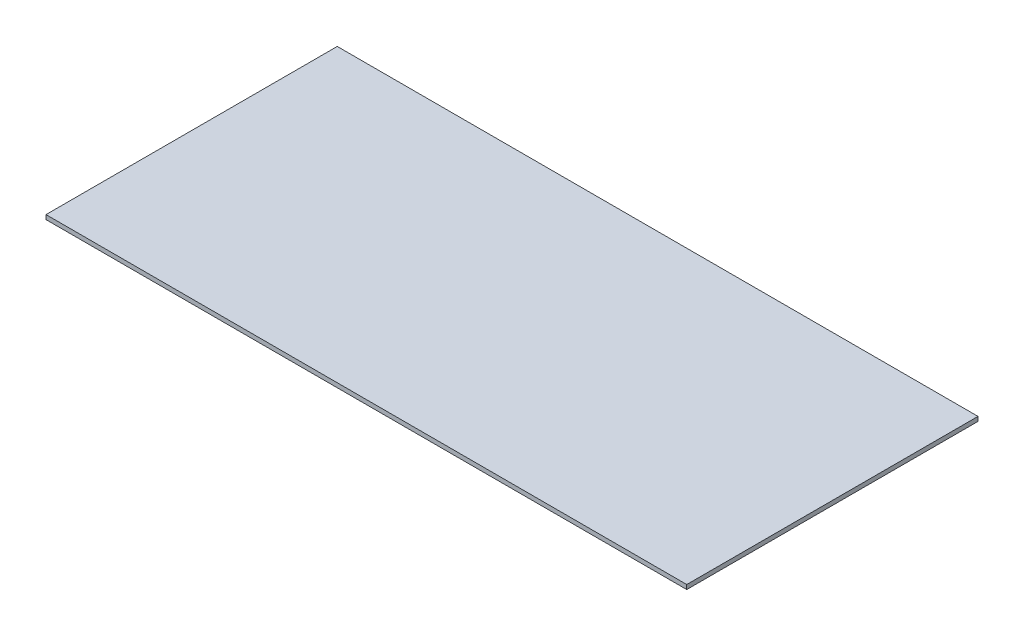
ISO-10303-21;
HEADER;
FILE_DESCRIPTION(('STEP AP214'),'2;1');
FILE_NAME('part.step','',(''),(''),'','','');
FILE_SCHEMA(('AUTOMOTIVE_DESIGN { 1 0 10303 214 1 1 1 1 }'));
ENDSEC;
DATA;
#1=APPLICATION_CONTEXT('core data for automotive mechanical design processes');
#2=APPLICATION_PROTOCOL_DEFINITION('international standard','automotive_design',2000,#1);
#3=PRODUCT_CONTEXT('',#1,'mechanical');
#4=PRODUCT('Part','Part','',(#3));
#5=PRODUCT_RELATED_PRODUCT_CATEGORY('part','',(#4));
#6=PRODUCT_DEFINITION_FORMATION('','',#4);
#7=PRODUCT_DEFINITION_CONTEXT('part definition',#1,'design');
#8=PRODUCT_DEFINITION('design','',#6,#7);
#9=PRODUCT_DEFINITION_SHAPE('','',#8);
#10=(LENGTH_UNIT() NAMED_UNIT(*) SI_UNIT(.MILLI.,.METRE.));
#11=(NAMED_UNIT(*) PLANE_ANGLE_UNIT() SI_UNIT($,.RADIAN.));
#12=(NAMED_UNIT(*) SI_UNIT($,.STERADIAN.) SOLID_ANGLE_UNIT());
#13=UNCERTAINTY_MEASURE_WITH_UNIT(LENGTH_MEASURE(1.E-05),#10,'distance_accuracy_value','');
#14=(GEOMETRIC_REPRESENTATION_CONTEXT(3) GLOBAL_UNCERTAINTY_ASSIGNED_CONTEXT((#13)) GLOBAL_UNIT_ASSIGNED_CONTEXT((#10,
#11,#12)) REPRESENTATION_CONTEXT('',''));
#15=CARTESIAN_POINT('',(0.,0.,0.));
#16=DIRECTION('',(0.,0.,1.));
#17=DIRECTION('',(1.,0.,0.));
#18=AXIS2_PLACEMENT_3D('',#15,#16,#17);
#19=CARTESIAN_POINT('',(16.0802370038619,3.,155.555555555556));
#20=DIRECTION('',(0.,0.,-1.));
#21=DIRECTION('',(-1.,0.,0.));
#22=AXIS2_PLACEMENT_3D('',#19,#20,#21);
#23=PLANE('',#22);
#24=DIRECTION('',(1.,0.,0.));
#25=VECTOR('',#24,1.);
#26=CARTESIAN_POINT('',(16.0802370038619,0.,155.555555555556));
#27=LINE('',#26,#25);
#28=CARTESIAN_POINT('',(16.0802370038619,0.,155.555555555556));
#29=VERTEX_POINT('',#28);
#30=CARTESIAN_POINT('',(456.080237003862,0.,155.555555555556));
#31=VERTEX_POINT('',#30);
#32=EDGE_CURVE('E151',#29,#31,#27,.T.);
#33=ORIENTED_EDGE('',*,*,#32,.T.);
#34=DIRECTION('',(0.,-1.,0.));
#35=VECTOR('',#34,1.);
#36=CARTESIAN_POINT('',(456.080237003862,3.,155.555555555556));
#37=LINE('',#36,#35);
#38=CARTESIAN_POINT('',(456.080237003862,3.,155.555555555556));
#39=VERTEX_POINT('',#38);
#40=EDGE_CURVE('E11',#39,#31,#37,.T.);
#41=ORIENTED_EDGE('',*,*,#40,.F.);
#42=DIRECTION('',(1.,0.,0.));
#43=VECTOR('',#42,1.);
#44=CARTESIAN_POINT('',(16.0802370038619,3.,155.555555555556));
#45=LINE('',#44,#43);
#46=CARTESIAN_POINT('',(16.0802370038619,3.,155.555555555556));
#47=VERTEX_POINT('',#46);
#48=EDGE_CURVE('E157',#47,#39,#45,.T.);
#49=ORIENTED_EDGE('',*,*,#48,.F.);
#50=DIRECTION('',(0.,-1.,0.));
#51=VECTOR('',#50,1.);
#52=CARTESIAN_POINT('',(16.0802370038619,3.,155.555555555556));
#53=LINE('',#52,#51);
#54=EDGE_CURVE('E172',#47,#29,#53,.T.);
#55=ORIENTED_EDGE('',*,*,#54,.T.);
#56=EDGE_LOOP('',(#33,#41,#49,#55));
#57=FACE_BOUND('',#56,.T.);
#58=ADVANCED_FACE('F43',(#57),#23,.F.);
#59=CARTESIAN_POINT('',(456.080237003862,3.,-44.4444444444444));
#60=DIRECTION('',(1.,0.,0.));
#61=DIRECTION('',(0.,0.,-1.));
#62=AXIS2_PLACEMENT_3D('',#59,#60,#61);
#63=PLANE('',#62);
#64=DIRECTION('',(0.,0.,1.));
#65=VECTOR('',#64,1.);
#66=CARTESIAN_POINT('',(456.080237003862,0.,-44.4444444444444));
#67=LINE('',#66,#65);
#68=CARTESIAN_POINT('',(456.080237003862,0.,-44.4444444444444));
#69=VERTEX_POINT('',#68);
#70=EDGE_CURVE('E176',#69,#31,#67,.T.);
#71=ORIENTED_EDGE('',*,*,#70,.F.);
#72=DIRECTION('',(0.,-1.,0.));
#73=VECTOR('',#72,1.);
#74=CARTESIAN_POINT('',(456.080237003862,3.,-44.4444444444444));
#75=LINE('',#74,#73);
#76=CARTESIAN_POINT('',(456.080237003862,3.,-44.4444444444444));
#77=VERTEX_POINT('',#76);
#78=EDGE_CURVE('E51',#77,#69,#75,.T.);
#79=ORIENTED_EDGE('',*,*,#78,.F.);
#80=DIRECTION('',(0.,0.,1.));
#81=VECTOR('',#80,1.);
#82=CARTESIAN_POINT('',(456.080237003862,3.,-44.4444444444444));
#83=LINE('',#82,#81);
#84=EDGE_CURVE('E160',#77,#39,#83,.T.);
#85=ORIENTED_EDGE('',*,*,#84,.T.);
#86=ORIENTED_EDGE('',*,*,#40,.T.);
#87=EDGE_LOOP('',(#71,#79,#85,#86));
#88=FACE_BOUND('',#87,.T.);
#89=ADVANCED_FACE('F199',(#88),#63,.T.);
#90=CARTESIAN_POINT('',(16.0802370038619,3.,-44.4444444444444));
#91=DIRECTION('',(0.,0.,-1.));
#92=DIRECTION('',(-1.,0.,0.));
#93=AXIS2_PLACEMENT_3D('',#90,#91,#92);
#94=PLANE('',#93);
#95=DIRECTION('',(1.,0.,0.));
#96=VECTOR('',#95,1.);
#97=CARTESIAN_POINT('',(16.0802370038619,0.,-44.4444444444444));
#98=LINE('',#97,#96);
#99=CARTESIAN_POINT('',(16.0802370038619,0.,-44.4444444444444));
#100=VERTEX_POINT('',#99);
#101=EDGE_CURVE('E180',#100,#69,#98,.T.);
#102=ORIENTED_EDGE('',*,*,#101,.F.);
#103=DIRECTION('',(0.,-1.,0.));
#104=VECTOR('',#103,1.);
#105=CARTESIAN_POINT('',(16.0802370038619,3.,-44.4444444444444));
#106=LINE('',#105,#104);
#107=CARTESIAN_POINT('',(16.0802370038619,3.,-44.4444444444444));
#108=VERTEX_POINT('',#107);
#109=EDGE_CURVE('E189',#108,#100,#106,.T.);
#110=ORIENTED_EDGE('',*,*,#109,.F.);
#111=DIRECTION('',(1.,0.,0.));
#112=VECTOR('',#111,1.);
#113=CARTESIAN_POINT('',(16.0802370038619,3.,-44.4444444444444));
#114=LINE('',#113,#112);
#115=EDGE_CURVE('E165',#108,#77,#114,.T.);
#116=ORIENTED_EDGE('',*,*,#115,.T.);
#117=ORIENTED_EDGE('',*,*,#78,.T.);
#118=EDGE_LOOP('',(#102,#110,#116,#117));
#119=FACE_BOUND('',#118,.T.);
#120=ADVANCED_FACE('F195',(#119),#94,.T.);
#121=CARTESIAN_POINT('',(16.0802370038619,3.,-44.4444444444444));
#122=DIRECTION('',(1.,0.,0.));
#123=DIRECTION('',(0.,0.,-1.));
#124=AXIS2_PLACEMENT_3D('',#121,#122,#123);
#125=PLANE('',#124);
#126=DIRECTION('',(0.,0.,1.));
#127=VECTOR('',#126,1.);
#128=CARTESIAN_POINT('',(16.0802370038619,0.,-44.4444444444444));
#129=LINE('',#128,#127);
#130=EDGE_CURVE('E161',#100,#29,#129,.T.);
#131=ORIENTED_EDGE('',*,*,#130,.T.);
#132=ORIENTED_EDGE('',*,*,#54,.F.);
#133=DIRECTION('',(0.,0.,1.));
#134=VECTOR('',#133,1.);
#135=CARTESIAN_POINT('',(16.0802370038619,3.,-44.4444444444444));
#136=LINE('',#135,#134);
#137=EDGE_CURVE('E169',#108,#47,#136,.T.);
#138=ORIENTED_EDGE('',*,*,#137,.F.);
#139=ORIENTED_EDGE('',*,*,#109,.T.);
#140=EDGE_LOOP('',(#131,#132,#138,#139));
#141=FACE_BOUND('',#140,.T.);
#142=ADVANCED_FACE('F207',(#141),#125,.F.);
#143=CARTESIAN_POINT('',(0.,3.,0.));
#144=DIRECTION('',(0.,-1.,0.));
#145=DIRECTION('',(0.,0.,-1.));
#146=AXIS2_PLACEMENT_3D('',#143,#144,#145);
#147=PLANE('',#146);
#148=ORIENTED_EDGE('',*,*,#48,.T.);
#149=ORIENTED_EDGE('',*,*,#84,.F.);
#150=ORIENTED_EDGE('',*,*,#115,.F.);
#151=ORIENTED_EDGE('',*,*,#137,.T.);
#152=EDGE_LOOP('',(#148,#149,#150,#151));
#153=FACE_BOUND('',#152,.T.);
#154=ADVANCED_FACE('F212',(#153),#147,.F.);
#155=CARTESIAN_POINT('',(0.,0.,0.));
#156=DIRECTION('',(0.,-1.,0.));
#157=DIRECTION('',(0.,0.,-1.));
#158=AXIS2_PLACEMENT_3D('',#155,#156,#157);
#159=PLANE('',#158);
#160=DIRECTION('',(0.,0.,1.));
#161=VECTOR('',#160,1.);
#162=CARTESIAN_POINT('',(34.0802370038619,0.,21.5555555555556));
#163=LINE('',#162,#161);
#164=CARTESIAN_POINT('',(34.0802370038619,0.,21.5555555555556));
#165=VERTEX_POINT('',#164);
#166=CARTESIAN_POINT('',(34.0802370038619,0.,91.5555555555556));
#167=VERTEX_POINT('',#166);
#168=EDGE_CURVE('E142',#165,#167,#163,.T.);
#169=ORIENTED_EDGE('',*,*,#168,.T.);
#170=DIRECTION('',(1.,0.,0.));
#171=VECTOR('',#170,1.);
#172=CARTESIAN_POINT('',(34.0802370038619,0.,91.5555555555556));
#173=LINE('',#172,#171);
#174=CARTESIAN_POINT('',(84.0802370038619,0.,91.5555555555556));
#175=VERTEX_POINT('',#174);
#176=EDGE_CURVE('E112',#167,#175,#173,.T.);
#177=ORIENTED_EDGE('',*,*,#176,.T.);
#178=DIRECTION('',(0.,0.,-1.));
#179=VECTOR('',#178,1.);
#180=CARTESIAN_POINT('',(84.0802370038619,0.,21.5555555555556));
#181=LINE('',#180,#179);
#182=CARTESIAN_POINT('',(84.0802370038619,0.,21.5555555555556));
#183=VERTEX_POINT('',#182);
#184=EDGE_CURVE('E63',#175,#183,#181,.T.);
#185=ORIENTED_EDGE('',*,*,#184,.T.);
#186=DIRECTION('',(-1.,0.,0.));
#187=VECTOR('',#186,1.);
#188=CARTESIAN_POINT('',(34.0802370038619,0.,21.5555555555556));
#189=LINE('',#188,#187);
#190=EDGE_CURVE('E58',#183,#165,#189,.T.);
#191=ORIENTED_EDGE('',*,*,#190,.T.);
#192=EDGE_LOOP('',(#169,#177,#185,#191));
#193=FACE_BOUND('',#192,.T.);
#194=ORIENTED_EDGE('',*,*,#32,.F.);
#195=ORIENTED_EDGE('',*,*,#130,.F.);
#196=ORIENTED_EDGE('',*,*,#101,.T.);
#197=ORIENTED_EDGE('',*,*,#70,.T.);
#198=EDGE_LOOP('',(#194,#195,#196,#197));
#199=FACE_BOUND('',#198,.T.);
#200=ADVANCED_FACE('F204',(#193,#199),#159,.T.);
#201=CARTESIAN_POINT('',(34.0802370038619,-15.,21.5555555555556));
#202=DIRECTION('',(-1.,0.,0.));
#203=DIRECTION('',(0.,0.,1.));
#204=AXIS2_PLACEMENT_3D('',#201,#202,#203);
#205=PLANE('',#204);
#206=ORIENTED_EDGE('',*,*,#168,.F.);
#207=DIRECTION('',(0.,1.,0.));
#208=VECTOR('',#207,1.);
#209=CARTESIAN_POINT('',(34.0802370038619,-15.,21.5555555555556));
#210=LINE('',#209,#208);
#211=CARTESIAN_POINT('',(34.0802370038619,-15.,21.5555555555556));
#212=VERTEX_POINT('',#211);
#213=EDGE_CURVE('E132',#212,#165,#210,.T.);
#214=ORIENTED_EDGE('',*,*,#213,.F.);
#215=DIRECTION('',(0.,0.,1.));
#216=VECTOR('',#215,1.);
#217=CARTESIAN_POINT('',(34.0802370038619,-15.,21.5555555555556));
#218=LINE('',#217,#216);
#219=CARTESIAN_POINT('',(34.0802370038619,-15.,91.5555555555556));
#220=VERTEX_POINT('',#219);
#221=EDGE_CURVE('E125',#212,#220,#218,.T.);
#222=ORIENTED_EDGE('',*,*,#221,.T.);
#223=DIRECTION('',(0.,1.,0.));
#224=VECTOR('',#223,1.);
#225=CARTESIAN_POINT('',(34.0802370038619,-15.,91.5555555555556));
#226=LINE('',#225,#224);
#227=EDGE_CURVE('E107',#220,#167,#226,.T.);
#228=ORIENTED_EDGE('',*,*,#227,.T.);
#229=EDGE_LOOP('',(#206,#214,#222,#228));
#230=FACE_BOUND('',#229,.T.);
#231=ADVANCED_FACE('F131',(#230),#205,.T.);
#232=CARTESIAN_POINT('',(34.0802370038619,-15.,21.5555555555556));
#233=DIRECTION('',(0.,0.,-1.));
#234=DIRECTION('',(-1.,0.,0.));
#235=AXIS2_PLACEMENT_3D('',#232,#233,#234);
#236=PLANE('',#235);
#237=ORIENTED_EDGE('',*,*,#190,.F.);
#238=DIRECTION('',(0.,1.,0.));
#239=VECTOR('',#238,1.);
#240=CARTESIAN_POINT('',(84.0802370038619,-15.,21.5555555555556));
#241=LINE('',#240,#239);
#242=CARTESIAN_POINT('',(84.0802370038619,-15.,21.5555555555556));
#243=VERTEX_POINT('',#242);
#244=EDGE_CURVE('E152',#243,#183,#241,.T.);
#245=ORIENTED_EDGE('',*,*,#244,.F.);
#246=DIRECTION('',(-1.,0.,0.));
#247=VECTOR('',#246,1.);
#248=CARTESIAN_POINT('',(34.0802370038619,-15.,21.5555555555556));
#249=LINE('',#248,#247);
#250=EDGE_CURVE('E118',#243,#212,#249,.T.);
#251=ORIENTED_EDGE('',*,*,#250,.T.);
#252=ORIENTED_EDGE('',*,*,#213,.T.);
#253=EDGE_LOOP('',(#237,#245,#251,#252));
#254=FACE_BOUND('',#253,.T.);
#255=ADVANCED_FACE('F258',(#254),#236,.T.);
#256=CARTESIAN_POINT('',(84.0802370038619,-15.,21.5555555555556));
#257=DIRECTION('',(1.,0.,0.));
#258=DIRECTION('',(0.,0.,-1.));
#259=AXIS2_PLACEMENT_3D('',#256,#257,#258);
#260=PLANE('',#259);
#261=ORIENTED_EDGE('',*,*,#184,.F.);
#262=DIRECTION('',(0.,1.,0.));
#263=VECTOR('',#262,1.);
#264=CARTESIAN_POINT('',(84.0802370038619,-15.,91.5555555555556));
#265=LINE('',#264,#263);
#266=CARTESIAN_POINT('',(84.0802370038619,-15.,91.5555555555556));
#267=VERTEX_POINT('',#266);
#268=EDGE_CURVE('E117',#267,#175,#265,.T.);
#269=ORIENTED_EDGE('',*,*,#268,.F.);
#270=DIRECTION('',(0.,0.,-1.));
#271=VECTOR('',#270,1.);
#272=CARTESIAN_POINT('',(84.0802370038619,-15.,21.5555555555556));
#273=LINE('',#272,#271);
#274=EDGE_CURVE('E128',#267,#243,#273,.T.);
#275=ORIENTED_EDGE('',*,*,#274,.T.);
#276=ORIENTED_EDGE('',*,*,#244,.T.);
#277=EDGE_LOOP('',(#261,#269,#275,#276));
#278=FACE_BOUND('',#277,.T.);
#279=ADVANCED_FACE('F267',(#278),#260,.T.);
#280=CARTESIAN_POINT('',(34.0802370038619,-15.,91.5555555555556));
#281=DIRECTION('',(0.,0.,1.));
#282=DIRECTION('',(1.,0.,0.));
#283=AXIS2_PLACEMENT_3D('',#280,#281,#282);
#284=PLANE('',#283);
#285=ORIENTED_EDGE('',*,*,#176,.F.);
#286=ORIENTED_EDGE('',*,*,#227,.F.);
#287=DIRECTION('',(1.,0.,0.));
#288=VECTOR('',#287,1.);
#289=CARTESIAN_POINT('',(34.0802370038619,-15.,91.5555555555556));
#290=LINE('',#289,#288);
#291=EDGE_CURVE('E111',#220,#267,#290,.T.);
#292=ORIENTED_EDGE('',*,*,#291,.T.);
#293=ORIENTED_EDGE('',*,*,#268,.T.);
#294=EDGE_LOOP('',(#285,#286,#292,#293));
#295=FACE_BOUND('',#294,.T.);
#296=ADVANCED_FACE('F109',(#295),#284,.T.);
#297=CARTESIAN_POINT('',(0.,-15.,0.));
#298=DIRECTION('',(0.,1.,0.));
#299=DIRECTION('',(0.,0.,1.));
#300=AXIS2_PLACEMENT_3D('',#297,#298,#299);
#301=PLANE('',#300);
#302=ORIENTED_EDGE('',*,*,#221,.F.);
#303=ORIENTED_EDGE('',*,*,#250,.F.);
#304=ORIENTED_EDGE('',*,*,#274,.F.);
#305=ORIENTED_EDGE('',*,*,#291,.F.);
#306=EDGE_LOOP('',(#302,#303,#304,#305));
#307=FACE_BOUND('',#306,.T.);
#308=ADVANCED_FACE('F123',(#307),#301,.F.);
#309=CLOSED_SHELL('',(#58,#89,#120,#142,#154,#200,#231,#255,#279,#296,#308));
#310=MANIFOLD_SOLID_BREP('B2',#309);
#311=ADVANCED_BREP_SHAPE_REPRESENTATION('',(#18,#310),#14);
#312=SHAPE_DEFINITION_REPRESENTATION(#9,#311);
ENDSEC;
END-ISO-10303-21;
